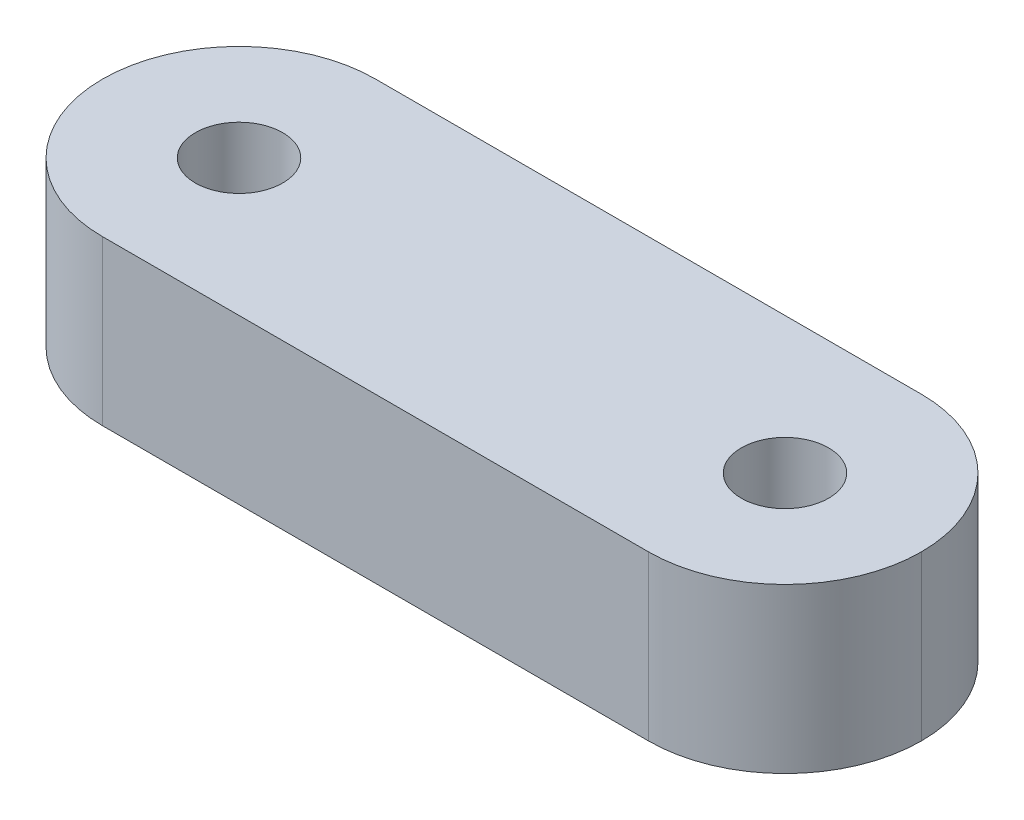
ISO-10303-21;
HEADER;
FILE_DESCRIPTION(('STEP AP214'),'2;1');
FILE_NAME('part.step','',(''),(''),'','','');
FILE_SCHEMA(('AUTOMOTIVE_DESIGN { 1 0 10303 214 1 1 1 1 }'));
ENDSEC;
DATA;
#1=APPLICATION_CONTEXT('core data for automotive mechanical design processes');
#2=APPLICATION_PROTOCOL_DEFINITION('international standard','automotive_design',2000,#1);
#3=PRODUCT_CONTEXT('',#1,'mechanical');
#4=PRODUCT('Part','Part','',(#3));
#5=PRODUCT_RELATED_PRODUCT_CATEGORY('part','',(#4));
#6=PRODUCT_DEFINITION_FORMATION('','',#4);
#7=PRODUCT_DEFINITION_CONTEXT('part definition',#1,'design');
#8=PRODUCT_DEFINITION('design','',#6,#7);
#9=PRODUCT_DEFINITION_SHAPE('','',#8);
#10=(LENGTH_UNIT() NAMED_UNIT(*) SI_UNIT(.MILLI.,.METRE.));
#11=(NAMED_UNIT(*) PLANE_ANGLE_UNIT() SI_UNIT($,.RADIAN.));
#12=(NAMED_UNIT(*) SI_UNIT($,.STERADIAN.) SOLID_ANGLE_UNIT());
#13=UNCERTAINTY_MEASURE_WITH_UNIT(LENGTH_MEASURE(1.E-05),#10,'distance_accuracy_value','');
#14=(GEOMETRIC_REPRESENTATION_CONTEXT(3) GLOBAL_UNCERTAINTY_ASSIGNED_CONTEXT((#13)) GLOBAL_UNIT_ASSIGNED_CONTEXT((#10,
#11,#12)) REPRESENTATION_CONTEXT('',''));
#15=CARTESIAN_POINT('',(0.,0.,0.));
#16=DIRECTION('',(0.,0.,1.));
#17=DIRECTION('',(1.,0.,0.));
#18=AXIS2_PLACEMENT_3D('',#15,#16,#17);
#19=CARTESIAN_POINT('',(-15.,6.,-5.));
#20=DIRECTION('',(0.,0.,1.));
#21=DIRECTION('',(1.,0.,0.));
#22=AXIS2_PLACEMENT_3D('',#19,#20,#21);
#23=PLANE('',#22);
#24=DIRECTION('',(-1.,0.,0.));
#25=VECTOR('',#24,1.);
#26=CARTESIAN_POINT('',(-15.,6.,-5.));
#27=LINE('',#26,#25);
#28=CARTESIAN_POINT('',(10.,6.,-5.));
#29=VERTEX_POINT('',#28);
#30=CARTESIAN_POINT('',(-10.,6.,-5.));
#31=VERTEX_POINT('',#30);
#32=EDGE_CURVE('E106',#29,#31,#27,.T.);
#33=ORIENTED_EDGE('',*,*,#32,.F.);
#34=DIRECTION('',(0.,-1.,0.));
#35=VECTOR('',#34,1.);
#36=CARTESIAN_POINT('',(10.,6.,-5.));
#37=LINE('',#36,#35);
#38=CARTESIAN_POINT('',(10.,0.,-5.));
#39=VERTEX_POINT('',#38);
#40=EDGE_CURVE('E91',#29,#39,#37,.T.);
#41=ORIENTED_EDGE('',*,*,#40,.T.);
#42=DIRECTION('',(-1.,0.,0.));
#43=VECTOR('',#42,1.);
#44=CARTESIAN_POINT('',(-15.,0.,-5.));
#45=LINE('',#44,#43);
#46=CARTESIAN_POINT('',(-10.,0.,-5.));
#47=VERTEX_POINT('',#46);
#48=EDGE_CURVE('E103',#39,#47,#45,.T.);
#49=ORIENTED_EDGE('',*,*,#48,.T.);
#50=DIRECTION('',(0.,-1.,0.));
#51=VECTOR('',#50,1.);
#52=CARTESIAN_POINT('',(-10.,6.,-5.));
#53=LINE('',#52,#51);
#54=EDGE_CURVE('E108',#47,#31,#53,.F.);
#55=ORIENTED_EDGE('',*,*,#54,.T.);
#56=EDGE_LOOP('',(#33,#41,#49,#55));
#57=FACE_BOUND('',#56,.T.);
#58=ADVANCED_FACE('F33',(#57),#23,.F.);
#59=CARTESIAN_POINT('',(-15.,6.,5.));
#60=DIRECTION('',(0.,0.,-1.));
#61=DIRECTION('',(-1.,0.,0.));
#62=AXIS2_PLACEMENT_3D('',#59,#60,#61);
#63=PLANE('',#62);
#64=DIRECTION('',(1.,0.,0.));
#65=VECTOR('',#64,1.);
#66=CARTESIAN_POINT('',(-15.,0.,5.));
#67=LINE('',#66,#65);
#68=CARTESIAN_POINT('',(-10.,0.,5.));
#69=VERTEX_POINT('',#68);
#70=CARTESIAN_POINT('',(10.,0.,5.));
#71=VERTEX_POINT('',#70);
#72=EDGE_CURVE('E112',#69,#71,#67,.T.);
#73=ORIENTED_EDGE('',*,*,#72,.T.);
#74=DIRECTION('',(0.,-1.,0.));
#75=VECTOR('',#74,1.);
#76=CARTESIAN_POINT('',(10.,6.,5.));
#77=LINE('',#76,#75);
#78=CARTESIAN_POINT('',(10.,6.,5.));
#79=VERTEX_POINT('',#78);
#80=EDGE_CURVE('E11',#71,#79,#77,.F.);
#81=ORIENTED_EDGE('',*,*,#80,.T.);
#82=DIRECTION('',(1.,0.,0.));
#83=VECTOR('',#82,1.);
#84=CARTESIAN_POINT('',(-15.,6.,5.));
#85=LINE('',#84,#83);
#86=CARTESIAN_POINT('',(-10.,6.,5.));
#87=VERTEX_POINT('',#86);
#88=EDGE_CURVE('E120',#87,#79,#85,.T.);
#89=ORIENTED_EDGE('',*,*,#88,.F.);
#90=DIRECTION('',(0.,-1.,0.));
#91=VECTOR('',#90,1.);
#92=CARTESIAN_POINT('',(-10.,6.,5.));
#93=LINE('',#92,#91);
#94=EDGE_CURVE('E42',#87,#69,#93,.T.);
#95=ORIENTED_EDGE('',*,*,#94,.T.);
#96=EDGE_LOOP('',(#73,#81,#89,#95));
#97=FACE_BOUND('',#96,.T.);
#98=ADVANCED_FACE('F165',(#97),#63,.F.);
#99=CARTESIAN_POINT('',(0.,6.,0.));
#100=DIRECTION('',(0.,1.,0.));
#101=DIRECTION('',(0.,0.,1.));
#102=AXIS2_PLACEMENT_3D('',#99,#100,#101);
#103=PLANE('',#102);
#104=CARTESIAN_POINT('',(-10.,6.,0.));
#105=DIRECTION('',(0.,1.,0.));
#106=DIRECTION('',(0.,0.,1.));
#107=AXIS2_PLACEMENT_3D('',#104,#105,#106);
#108=CIRCLE('',#107,1.6);
#109=CARTESIAN_POINT('',(-10.,6.,1.6));
#110=VERTEX_POINT('',#109);
#111=EDGE_CURVE('E135',#110,#110,#108,.T.);
#112=ORIENTED_EDGE('',*,*,#111,.F.);
#113=EDGE_LOOP('',(#112));
#114=FACE_BOUND('',#113,.T.);
#115=CARTESIAN_POINT('',(10.,6.,0.));
#116=DIRECTION('',(0.,1.,0.));
#117=DIRECTION('',(0.,0.,1.));
#118=AXIS2_PLACEMENT_3D('',#115,#116,#117);
#119=CIRCLE('',#118,1.6);
#120=CARTESIAN_POINT('',(10.,6.,1.6));
#121=VERTEX_POINT('',#120);
#122=EDGE_CURVE('E117',#121,#121,#119,.T.);
#123=ORIENTED_EDGE('',*,*,#122,.F.);
#124=EDGE_LOOP('',(#123));
#125=FACE_BOUND('',#124,.T.);
#126=CARTESIAN_POINT('',(10.,6.,0.));
#127=DIRECTION('',(0.,1.,0.));
#128=DIRECTION('',(0.,0.,1.));
#129=AXIS2_PLACEMENT_3D('',#126,#127,#128);
#130=CIRCLE('',#129,5.);
#131=CARTESIAN_POINT('',(15.,6.,0.));
#132=VERTEX_POINT('',#131);
#133=EDGE_CURVE('E130',#79,#132,#130,.T.);
#134=ORIENTED_EDGE('',*,*,#133,.T.);
#135=CARTESIAN_POINT('',(10.,6.,0.));
#136=DIRECTION('',(0.,1.,0.));
#137=DIRECTION('',(0.,0.,1.));
#138=AXIS2_PLACEMENT_3D('',#135,#136,#137);
#139=CIRCLE('',#138,5.);
#140=EDGE_CURVE('E132',#132,#29,#139,.T.);
#141=ORIENTED_EDGE('',*,*,#140,.T.);
#142=ORIENTED_EDGE('',*,*,#32,.T.);
#143=CARTESIAN_POINT('',(-10.,6.,0.));
#144=DIRECTION('',(0.,1.,0.));
#145=DIRECTION('',(0.,0.,1.));
#146=AXIS2_PLACEMENT_3D('',#143,#144,#145);
#147=CIRCLE('',#146,5.);
#148=CARTESIAN_POINT('',(-15.,6.,0.));
#149=VERTEX_POINT('',#148);
#150=EDGE_CURVE('E97',#31,#149,#147,.T.);
#151=ORIENTED_EDGE('',*,*,#150,.T.);
#152=CARTESIAN_POINT('',(-10.,6.,0.));
#153=DIRECTION('',(0.,1.,0.));
#154=DIRECTION('',(0.,0.,1.));
#155=AXIS2_PLACEMENT_3D('',#152,#153,#154);
#156=CIRCLE('',#155,5.);
#157=EDGE_CURVE('E55',#149,#87,#156,.T.);
#158=ORIENTED_EDGE('',*,*,#157,.T.);
#159=ORIENTED_EDGE('',*,*,#88,.T.);
#160=EDGE_LOOP('',(#134,#141,#142,#151,#158,#159));
#161=FACE_BOUND('',#160,.T.);
#162=ADVANCED_FACE('F146',(#114,#125,#161),#103,.T.);
#163=CARTESIAN_POINT('',(0.,0.,0.));
#164=DIRECTION('',(0.,1.,0.));
#165=DIRECTION('',(0.,0.,1.));
#166=AXIS2_PLACEMENT_3D('',#163,#164,#165);
#167=PLANE('',#166);
#168=CARTESIAN_POINT('',(-10.,0.,0.));
#169=DIRECTION('',(0.,1.,0.));
#170=DIRECTION('',(0.,0.,1.));
#171=AXIS2_PLACEMENT_3D('',#168,#169,#170);
#172=CIRCLE('',#171,1.6);
#173=CARTESIAN_POINT('',(-10.,0.,1.6));
#174=VERTEX_POINT('',#173);
#175=EDGE_CURVE('E137',#174,#174,#172,.T.);
#176=ORIENTED_EDGE('',*,*,#175,.T.);
#177=EDGE_LOOP('',(#176));
#178=FACE_BOUND('',#177,.T.);
#179=CARTESIAN_POINT('',(10.,0.,0.));
#180=DIRECTION('',(0.,1.,0.));
#181=DIRECTION('',(0.,0.,1.));
#182=AXIS2_PLACEMENT_3D('',#179,#180,#181);
#183=CIRCLE('',#182,1.6);
#184=CARTESIAN_POINT('',(10.,0.,1.6));
#185=VERTEX_POINT('',#184);
#186=EDGE_CURVE('E113',#185,#185,#183,.T.);
#187=ORIENTED_EDGE('',*,*,#186,.T.);
#188=EDGE_LOOP('',(#187));
#189=FACE_BOUND('',#188,.T.);
#190=ORIENTED_EDGE('',*,*,#48,.F.);
#191=CARTESIAN_POINT('',(10.,0.,0.));
#192=DIRECTION('',(0.,1.,0.));
#193=DIRECTION('',(0.,0.,1.));
#194=AXIS2_PLACEMENT_3D('',#191,#192,#193);
#195=CIRCLE('',#194,5.);
#196=CARTESIAN_POINT('',(15.,0.,0.));
#197=VERTEX_POINT('',#196);
#198=EDGE_CURVE('E87',#39,#197,#195,.F.);
#199=ORIENTED_EDGE('',*,*,#198,.T.);
#200=CARTESIAN_POINT('',(10.,0.,0.));
#201=DIRECTION('',(0.,1.,0.));
#202=DIRECTION('',(0.,0.,1.));
#203=AXIS2_PLACEMENT_3D('',#200,#201,#202);
#204=CIRCLE('',#203,5.);
#205=EDGE_CURVE('E98',#197,#71,#204,.F.);
#206=ORIENTED_EDGE('',*,*,#205,.T.);
#207=ORIENTED_EDGE('',*,*,#72,.F.);
#208=CARTESIAN_POINT('',(-10.,0.,0.));
#209=DIRECTION('',(0.,1.,0.));
#210=DIRECTION('',(0.,0.,1.));
#211=AXIS2_PLACEMENT_3D('',#208,#209,#210);
#212=CIRCLE('',#211,5.);
#213=CARTESIAN_POINT('',(-15.,0.,0.));
#214=VERTEX_POINT('',#213);
#215=EDGE_CURVE('E125',#69,#214,#212,.F.);
#216=ORIENTED_EDGE('',*,*,#215,.T.);
#217=CARTESIAN_POINT('',(-10.,0.,0.));
#218=DIRECTION('',(0.,1.,0.));
#219=DIRECTION('',(0.,0.,1.));
#220=AXIS2_PLACEMENT_3D('',#217,#218,#219);
#221=CIRCLE('',#220,5.);
#222=EDGE_CURVE('E107',#214,#47,#221,.F.);
#223=ORIENTED_EDGE('',*,*,#222,.T.);
#224=EDGE_LOOP('',(#190,#199,#206,#207,#216,#223));
#225=FACE_BOUND('',#224,.T.);
#226=ADVANCED_FACE('F110',(#178,#189,#225),#167,.F.);
#227=CARTESIAN_POINT('',(10.,6.,0.));
#228=DIRECTION('',(0.,1.,0.));
#229=DIRECTION('',(0.,0.,1.));
#230=AXIS2_PLACEMENT_3D('',#227,#228,#229);
#231=CYLINDRICAL_SURFACE('',#230,1.6);
#232=ORIENTED_EDGE('',*,*,#186,.F.);
#233=EDGE_LOOP('',(#232));
#234=FACE_BOUND('',#233,.T.);
#235=ORIENTED_EDGE('',*,*,#122,.T.);
#236=EDGE_LOOP('',(#235));
#237=FACE_BOUND('',#236,.T.);
#238=ADVANCED_FACE('F159',(#234,#237),#231,.F.);
#239=CARTESIAN_POINT('',(-10.,6.,0.));
#240=DIRECTION('',(0.,1.,0.));
#241=DIRECTION('',(0.,0.,1.));
#242=AXIS2_PLACEMENT_3D('',#239,#240,#241);
#243=CYLINDRICAL_SURFACE('',#242,1.6);
#244=ORIENTED_EDGE('',*,*,#175,.F.);
#245=EDGE_LOOP('',(#244));
#246=FACE_BOUND('',#245,.T.);
#247=ORIENTED_EDGE('',*,*,#111,.T.);
#248=EDGE_LOOP('',(#247));
#249=FACE_BOUND('',#248,.T.);
#250=ADVANCED_FACE('F155',(#246,#249),#243,.F.);
#251=CARTESIAN_POINT('',(10.,6.,0.));
#252=DIRECTION('',(0.,-1.,0.));
#253=DIRECTION('',(0.,0.,-1.));
#254=AXIS2_PLACEMENT_3D('',#251,#252,#253);
#255=CYLINDRICAL_SURFACE('',#254,5.);
#256=DIRECTION('',(0.,-1.,0.));
#257=VECTOR('',#256,1.);
#258=CARTESIAN_POINT('',(15.,6.,0.));
#259=LINE('',#258,#257);
#260=EDGE_CURVE('E93',#132,#197,#259,.T.);
#261=ORIENTED_EDGE('',*,*,#260,.F.);
#262=ORIENTED_EDGE('',*,*,#133,.F.);
#263=ORIENTED_EDGE('',*,*,#80,.F.);
#264=ORIENTED_EDGE('',*,*,#205,.F.);
#265=EDGE_LOOP('',(#261,#262,#263,#264));
#266=FACE_BOUND('',#265,.T.);
#267=ADVANCED_FACE('F158',(#266),#255,.T.);
#268=CARTESIAN_POINT('',(10.,6.,0.));
#269=DIRECTION('',(0.,-1.,0.));
#270=DIRECTION('',(0.,0.,-1.));
#271=AXIS2_PLACEMENT_3D('',#268,#269,#270);
#272=CYLINDRICAL_SURFACE('',#271,5.);
#273=ORIENTED_EDGE('',*,*,#140,.F.);
#274=ORIENTED_EDGE('',*,*,#260,.T.);
#275=ORIENTED_EDGE('',*,*,#198,.F.);
#276=ORIENTED_EDGE('',*,*,#40,.F.);
#277=EDGE_LOOP('',(#273,#274,#275,#276));
#278=FACE_BOUND('',#277,.T.);
#279=ADVANCED_FACE('F90',(#278),#272,.T.);
#280=CARTESIAN_POINT('',(-10.,6.,0.));
#281=DIRECTION('',(0.,-1.,0.));
#282=DIRECTION('',(0.,0.,-1.));
#283=AXIS2_PLACEMENT_3D('',#280,#281,#282);
#284=CYLINDRICAL_SURFACE('',#283,5.);
#285=DIRECTION('',(0.,-1.,0.));
#286=VECTOR('',#285,1.);
#287=CARTESIAN_POINT('',(-15.,6.,0.));
#288=LINE('',#287,#286);
#289=EDGE_CURVE('E37',#149,#214,#288,.T.);
#290=ORIENTED_EDGE('',*,*,#289,.F.);
#291=ORIENTED_EDGE('',*,*,#150,.F.);
#292=ORIENTED_EDGE('',*,*,#54,.F.);
#293=ORIENTED_EDGE('',*,*,#222,.F.);
#294=EDGE_LOOP('',(#290,#291,#292,#293));
#295=FACE_BOUND('',#294,.T.);
#296=ADVANCED_FACE('F35',(#295),#284,.T.);
#297=CARTESIAN_POINT('',(-10.,6.,0.));
#298=DIRECTION('',(0.,-1.,0.));
#299=DIRECTION('',(0.,0.,-1.));
#300=AXIS2_PLACEMENT_3D('',#297,#298,#299);
#301=CYLINDRICAL_SURFACE('',#300,5.);
#302=ORIENTED_EDGE('',*,*,#157,.F.);
#303=ORIENTED_EDGE('',*,*,#289,.T.);
#304=ORIENTED_EDGE('',*,*,#215,.F.);
#305=ORIENTED_EDGE('',*,*,#94,.F.);
#306=EDGE_LOOP('',(#302,#303,#304,#305));
#307=FACE_BOUND('',#306,.T.);
#308=ADVANCED_FACE('F142',(#307),#301,.T.);
#309=CLOSED_SHELL('',(#58,#98,#162,#226,#238,#250,#267,#279,#296,#308));
#310=MANIFOLD_SOLID_BREP('B2',#309);
#311=ADVANCED_BREP_SHAPE_REPRESENTATION('',(#18,#310),#14);
#312=SHAPE_DEFINITION_REPRESENTATION(#9,#311);
ENDSEC;
END-ISO-10303-21;
